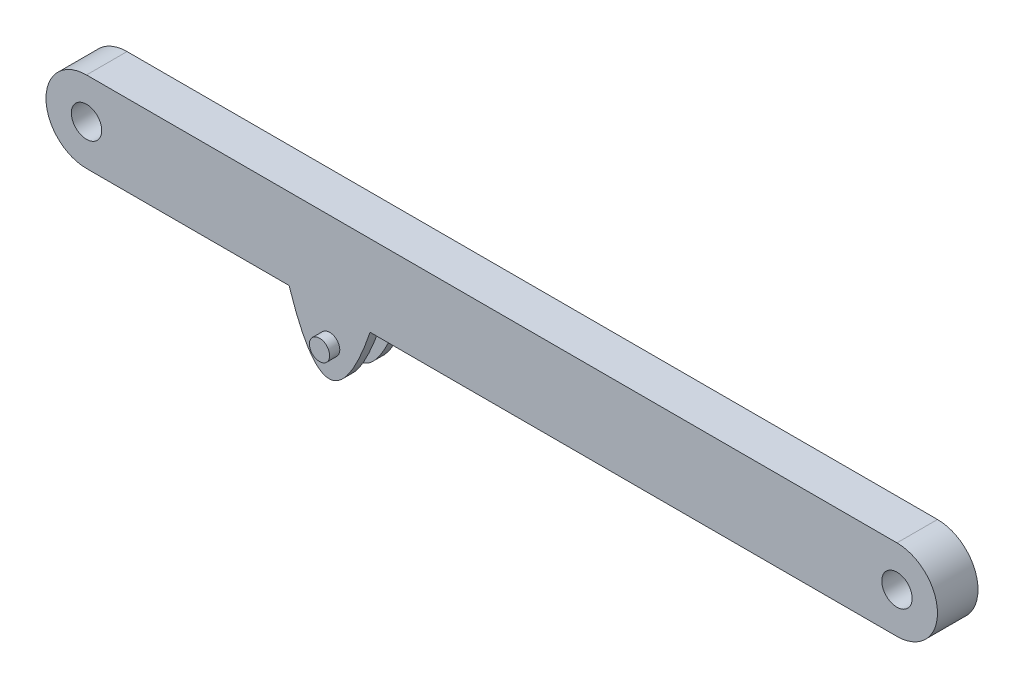
ISO-10303-21;
HEADER;
FILE_DESCRIPTION(('STEP AP214'),'2;1');
FILE_NAME('part.step','',(''),(''),'','','');
FILE_SCHEMA(('AUTOMOTIVE_DESIGN { 1 0 10303 214 1 1 1 1 }'));
ENDSEC;
DATA;
#1=APPLICATION_CONTEXT('core data for automotive mechanical design processes');
#2=APPLICATION_PROTOCOL_DEFINITION('international standard','automotive_design',2000,#1);
#3=PRODUCT_CONTEXT('',#1,'mechanical');
#4=PRODUCT('Part','Part','',(#3));
#5=PRODUCT_RELATED_PRODUCT_CATEGORY('part','',(#4));
#6=PRODUCT_DEFINITION_FORMATION('','',#4);
#7=PRODUCT_DEFINITION_CONTEXT('part definition',#1,'design');
#8=PRODUCT_DEFINITION('design','',#6,#7);
#9=PRODUCT_DEFINITION_SHAPE('','',#8);
#10=(LENGTH_UNIT() NAMED_UNIT(*) SI_UNIT(.MILLI.,.METRE.));
#11=(NAMED_UNIT(*) PLANE_ANGLE_UNIT() SI_UNIT($,.RADIAN.));
#12=(NAMED_UNIT(*) SI_UNIT($,.STERADIAN.) SOLID_ANGLE_UNIT());
#13=UNCERTAINTY_MEASURE_WITH_UNIT(LENGTH_MEASURE(1.E-05),#10,'distance_accuracy_value','');
#14=(GEOMETRIC_REPRESENTATION_CONTEXT(3) GLOBAL_UNCERTAINTY_ASSIGNED_CONTEXT((#13)) GLOBAL_UNIT_ASSIGNED_CONTEXT((#10,
#11,#12)) REPRESENTATION_CONTEXT('',''));
#15=CARTESIAN_POINT('',(0.,0.,0.));
#16=DIRECTION('',(0.,0.,1.));
#17=DIRECTION('',(1.,0.,0.));
#18=AXIS2_PLACEMENT_3D('',#15,#16,#17);
#19=CARTESIAN_POINT('',(-200.,0.,20.));
#20=DIRECTION('',(0.,0.,1.));
#21=DIRECTION('',(1.,0.,0.));
#22=AXIS2_PLACEMENT_3D('',#19,#20,#21);
#23=PLANE('',#22);
#24=CARTESIAN_POINT('',(-200.,0.,20.));
#25=DIRECTION('',(0.,0.,1.));
#26=DIRECTION('',(1.,0.,0.));
#27=AXIS2_PLACEMENT_3D('',#24,#25,#26);
#28=CIRCLE('',#27,20.);
#29=CARTESIAN_POINT('',(-200.,20.,20.));
#30=VERTEX_POINT('',#29);
#31=CARTESIAN_POINT('',(-200.,-20.,20.));
#32=VERTEX_POINT('',#31);
#33=EDGE_CURVE('E259',#30,#32,#28,.T.);
#34=ORIENTED_EDGE('',*,*,#33,.T.);
#35=DIRECTION('',(1.,0.,0.));
#36=VECTOR('',#35,1.);
#37=CARTESIAN_POINT('',(-200.,-20.,20.));
#38=LINE('',#37,#36);
#39=CARTESIAN_POINT('',(-100.037555,-20.,20.));
#40=VERTEX_POINT('',#39);
#41=EDGE_CURVE('E304',#32,#40,#38,.T.);
#42=ORIENTED_EDGE('',*,*,#41,.T.);
#43=CARTESIAN_POINT('',(-100.037555,-20.,20.));
#44=CARTESIAN_POINT('',(-80.4932082001175,-80.001537629147,20.));
#45=CARTESIAN_POINT('',(-60.037555,-20.,20.));
#46=B_SPLINE_CURVE_WITH_KNOTS('',2,(#43,#44,#45),.UNSPECIFIED.,.F.,.F.,(3,3),(0.,1.),.UNSPECIFIED.);
#47=CARTESIAN_POINT('',(-60.037555,-20.,20.));
#48=VERTEX_POINT('',#47);
#49=EDGE_CURVE('E55',#40,#48,#46,.T.);
#50=ORIENTED_EDGE('',*,*,#49,.T.);
#51=CARTESIAN_POINT('',(200.,-19.9999999999999,20.));
#52=VERTEX_POINT('',#51);
#53=EDGE_CURVE('E303',#48,#52,#38,.T.);
#54=ORIENTED_EDGE('',*,*,#53,.T.);
#55=CARTESIAN_POINT('',(200.,0.,20.));
#56=DIRECTION('',(0.,0.,1.));
#57=DIRECTION('',(1.,0.,0.));
#58=AXIS2_PLACEMENT_3D('',#55,#56,#57);
#59=CIRCLE('',#58,20.);
#60=CARTESIAN_POINT('',(200.,20.0000000000001,20.));
#61=VERTEX_POINT('',#60);
#62=EDGE_CURVE('E306',#52,#61,#59,.T.);
#63=ORIENTED_EDGE('',*,*,#62,.T.);
#64=DIRECTION('',(-1.,0.,0.));
#65=VECTOR('',#64,1.);
#66=CARTESIAN_POINT('',(-200.,20.,20.));
#67=LINE('',#66,#65);
#68=EDGE_CURVE('E250',#61,#30,#67,.T.);
#69=ORIENTED_EDGE('',*,*,#68,.T.);
#70=EDGE_LOOP('',(#34,#42,#50,#54,#63,#69));
#71=FACE_BOUND('',#70,.T.);
#72=CARTESIAN_POINT('',(200.,0.,20.));
#73=DIRECTION('',(0.,0.,1.));
#74=DIRECTION('',(1.,0.,0.));
#75=AXIS2_PLACEMENT_3D('',#72,#73,#74);
#76=CIRCLE('',#75,7.50000000000001);
#77=CARTESIAN_POINT('',(207.5,0.,20.));
#78=VERTEX_POINT('',#77);
#79=EDGE_CURVE('E247',#78,#78,#76,.T.);
#80=ORIENTED_EDGE('',*,*,#79,.F.);
#81=EDGE_LOOP('',(#80));
#82=FACE_BOUND('',#81,.T.);
#83=CARTESIAN_POINT('',(-200.,0.,20.));
#84=DIRECTION('',(0.,0.,1.));
#85=DIRECTION('',(1.,0.,0.));
#86=AXIS2_PLACEMENT_3D('',#83,#84,#85);
#87=CIRCLE('',#86,7.50000000000001);
#88=CARTESIAN_POINT('',(-192.5,0.,20.));
#89=VERTEX_POINT('',#88);
#90=EDGE_CURVE('E289',#89,#89,#87,.T.);
#91=ORIENTED_EDGE('',*,*,#90,.F.);
#92=EDGE_LOOP('',(#91));
#93=FACE_BOUND('',#92,.T.);
#94=CARTESIAN_POINT('',(-80.,-35.,20.));
#95=DIRECTION('',(0.,0.,1.));
#96=DIRECTION('',(1.,0.,0.));
#97=AXIS2_PLACEMENT_3D('',#94,#95,#96);
#98=CIRCLE('',#97,4.99999999999999);
#99=CARTESIAN_POINT('',(-75.,-35.,20.));
#100=VERTEX_POINT('',#99);
#101=EDGE_CURVE('E137',#100,#100,#98,.F.);
#102=ORIENTED_EDGE('',*,*,#101,.T.);
#103=EDGE_LOOP('',(#102));
#104=FACE_BOUND('',#103,.T.);
#105=ADVANCED_FACE('F39',(#71,#82,#93,#104),#23,.T.);
#106=CARTESIAN_POINT('',(-80.2653816000587,-50.0007688145735,15.));
#107=DIRECTION('',(0.,0.,1.));
#108=DIRECTION('',(-1.,0.,0.));
#109=AXIS2_PLACEMENT_3D('',#106,#107,#108);
#110=PLANE('',#109);
#111=CARTESIAN_POINT('',(-100.037555,-20.,15.));
#112=CARTESIAN_POINT('',(-80.4932082001175,-80.001537629147,15.));
#113=CARTESIAN_POINT('',(-60.037555,-20.,15.));
#114=B_SPLINE_CURVE_WITH_KNOTS('',2,(#111,#112,#113),.UNSPECIFIED.,.F.,.F.,(3,3),(0.,1.),.UNSPECIFIED.);
#115=CARTESIAN_POINT('',(-100.037555,-20.,15.));
#116=VERTEX_POINT('',#115);
#117=CARTESIAN_POINT('',(-60.037555,-20.,15.));
#118=VERTEX_POINT('',#117);
#119=EDGE_CURVE('E107',#116,#118,#114,.T.);
#120=ORIENTED_EDGE('',*,*,#119,.F.);
#121=DIRECTION('',(-1.,0.,0.));
#122=VECTOR('',#121,1.);
#123=CARTESIAN_POINT('',(-100.037555,-20.,15.));
#124=LINE('',#123,#122);
#125=EDGE_CURVE('E117',#118,#116,#124,.T.);
#126=ORIENTED_EDGE('',*,*,#125,.F.);
#127=EDGE_LOOP('',(#120,#126));
#128=FACE_BOUND('',#127,.T.);
#129=CARTESIAN_POINT('',(-80.,-35.,15.));
#130=DIRECTION('',(0.,0.,1.));
#131=DIRECTION('',(1.,0.,0.));
#132=AXIS2_PLACEMENT_3D('',#129,#130,#131);
#133=CIRCLE('',#132,4.99999999999999);
#134=CARTESIAN_POINT('',(-75.,-35.,15.));
#135=VERTEX_POINT('',#134);
#136=EDGE_CURVE('E11',#135,#135,#133,.F.);
#137=ORIENTED_EDGE('',*,*,#136,.F.);
#138=EDGE_LOOP('',(#137));
#139=FACE_BOUND('',#138,.T.);
#140=ADVANCED_FACE('F115',(#128,#139),#110,.F.);
#141=CARTESIAN_POINT('',(-200.,-20.,20.));
#142=DIRECTION('',(0.,1.,0.));
#143=DIRECTION('',(-1.,0.,0.));
#144=AXIS2_PLACEMENT_3D('',#141,#142,#143);
#145=PLANE('',#144);
#146=ORIENTED_EDGE('',*,*,#125,.T.);
#147=DIRECTION('',(0.,0.,1.));
#148=VECTOR('',#147,1.);
#149=CARTESIAN_POINT('',(-100.037555,-20.,15.));
#150=LINE('',#149,#148);
#151=EDGE_CURVE('E104',#116,#40,#150,.T.);
#152=ORIENTED_EDGE('',*,*,#151,.T.);
#153=ORIENTED_EDGE('',*,*,#41,.F.);
#154=DIRECTION('',(0.,0.,-1.));
#155=VECTOR('',#154,1.);
#156=CARTESIAN_POINT('',(-200.,-20.,20.));
#157=LINE('',#156,#155);
#158=CARTESIAN_POINT('',(-200.,-20.,0.));
#159=VERTEX_POINT('',#158);
#160=EDGE_CURVE('E48',#32,#159,#157,.T.);
#161=ORIENTED_EDGE('',*,*,#160,.T.);
#162=DIRECTION('',(1.,0.,0.));
#163=VECTOR('',#162,1.);
#164=CARTESIAN_POINT('',(-200.,-20.,0.));
#165=LINE('',#164,#163);
#166=CARTESIAN_POINT('',(-100.037555,-20.,0.));
#167=VERTEX_POINT('',#166);
#168=EDGE_CURVE('E237',#159,#167,#165,.T.);
#169=ORIENTED_EDGE('',*,*,#168,.T.);
#170=DIRECTION('',(0.,0.,-1.));
#171=VECTOR('',#170,1.);
#172=CARTESIAN_POINT('',(-100.037555,-20.,5.));
#173=LINE('',#172,#171);
#174=CARTESIAN_POINT('',(-100.037555,-20.,5.));
#175=VERTEX_POINT('',#174);
#176=EDGE_CURVE('E63',#175,#167,#173,.T.);
#177=ORIENTED_EDGE('',*,*,#176,.F.);
#178=DIRECTION('',(-1.,0.,0.));
#179=VECTOR('',#178,1.);
#180=CARTESIAN_POINT('',(-100.037555,-20.,5.));
#181=LINE('',#180,#179);
#182=CARTESIAN_POINT('',(-60.037555,-20.,5.));
#183=VERTEX_POINT('',#182);
#184=EDGE_CURVE('E158',#183,#175,#181,.T.);
#185=ORIENTED_EDGE('',*,*,#184,.F.);
#186=DIRECTION('',(0.,0.,-1.));
#187=VECTOR('',#186,1.);
#188=CARTESIAN_POINT('',(-60.037555,-20.,5.));
#189=LINE('',#188,#187);
#190=CARTESIAN_POINT('',(-60.037555,-20.,0.));
#191=VERTEX_POINT('',#190);
#192=EDGE_CURVE('E285',#183,#191,#189,.T.);
#193=ORIENTED_EDGE('',*,*,#192,.T.);
#194=CARTESIAN_POINT('',(200.,-19.9999999999999,0.));
#195=VERTEX_POINT('',#194);
#196=EDGE_CURVE('E242',#191,#195,#165,.T.);
#197=ORIENTED_EDGE('',*,*,#196,.T.);
#198=DIRECTION('',(0.,0.,-1.));
#199=VECTOR('',#198,1.);
#200=CARTESIAN_POINT('',(200.,-19.9999999999999,20.));
#201=LINE('',#200,#199);
#202=EDGE_CURVE('E267',#52,#195,#201,.T.);
#203=ORIENTED_EDGE('',*,*,#202,.F.);
#204=ORIENTED_EDGE('',*,*,#53,.F.);
#205=DIRECTION('',(0.,0.,1.));
#206=VECTOR('',#205,1.);
#207=CARTESIAN_POINT('',(-60.037555,-20.,15.));
#208=LINE('',#207,#206);
#209=EDGE_CURVE('E112',#118,#48,#208,.T.);
#210=ORIENTED_EDGE('',*,*,#209,.F.);
#211=EDGE_LOOP('',(#146,#152,#153,#161,#169,#177,#185,#193,#197,#203,#204,#210));
#212=FACE_BOUND('',#211,.T.);
#213=ADVANCED_FACE('F121',(#212),#145,.F.);
#214=CARTESIAN_POINT('',(-200.,0.,20.));
#215=DIRECTION('',(0.,0.,-1.));
#216=DIRECTION('',(-1.,0.,0.));
#217=AXIS2_PLACEMENT_3D('',#214,#215,#216);
#218=CYLINDRICAL_SURFACE('',#217,20.);
#219=CARTESIAN_POINT('',(-200.,0.,0.));
#220=DIRECTION('',(0.,0.,1.));
#221=DIRECTION('',(1.,0.,0.));
#222=AXIS2_PLACEMENT_3D('',#219,#220,#221);
#223=CIRCLE('',#222,20.);
#224=CARTESIAN_POINT('',(-200.,20.,0.));
#225=VERTEX_POINT('',#224);
#226=EDGE_CURVE('E233',#225,#159,#223,.T.);
#227=ORIENTED_EDGE('',*,*,#226,.T.);
#228=ORIENTED_EDGE('',*,*,#160,.F.);
#229=ORIENTED_EDGE('',*,*,#33,.F.);
#230=DIRECTION('',(0.,0.,-1.));
#231=VECTOR('',#230,1.);
#232=CARTESIAN_POINT('',(-200.,20.,20.));
#233=LINE('',#232,#231);
#234=EDGE_CURVE('E260',#30,#225,#233,.T.);
#235=ORIENTED_EDGE('',*,*,#234,.T.);
#236=EDGE_LOOP('',(#227,#228,#229,#235));
#237=FACE_BOUND('',#236,.T.);
#238=ADVANCED_FACE('F41',(#237),#218,.T.);
#239=CARTESIAN_POINT('',(200.,0.,20.));
#240=DIRECTION('',(0.,0.,-1.));
#241=DIRECTION('',(-1.,0.,0.));
#242=AXIS2_PLACEMENT_3D('',#239,#240,#241);
#243=CYLINDRICAL_SURFACE('',#242,20.);
#244=CARTESIAN_POINT('',(200.,0.,0.));
#245=DIRECTION('',(0.,0.,1.));
#246=DIRECTION('',(1.,0.,0.));
#247=AXIS2_PLACEMENT_3D('',#244,#245,#246);
#248=CIRCLE('',#247,20.);
#249=CARTESIAN_POINT('',(200.,20.0000000000001,0.));
#250=VERTEX_POINT('',#249);
#251=EDGE_CURVE('E254',#195,#250,#248,.T.);
#252=ORIENTED_EDGE('',*,*,#251,.T.);
#253=DIRECTION('',(0.,0.,-1.));
#254=VECTOR('',#253,1.);
#255=CARTESIAN_POINT('',(200.,20.0000000000001,20.));
#256=LINE('',#255,#254);
#257=EDGE_CURVE('E263',#61,#250,#256,.T.);
#258=ORIENTED_EDGE('',*,*,#257,.F.);
#259=ORIENTED_EDGE('',*,*,#62,.F.);
#260=ORIENTED_EDGE('',*,*,#202,.T.);
#261=EDGE_LOOP('',(#252,#258,#259,#260));
#262=FACE_BOUND('',#261,.T.);
#263=ADVANCED_FACE('F188',(#262),#243,.T.);
#264=CARTESIAN_POINT('',(-200.,20.,20.));
#265=DIRECTION('',(0.,-1.,0.));
#266=DIRECTION('',(1.,0.,0.));
#267=AXIS2_PLACEMENT_3D('',#264,#265,#266);
#268=PLANE('',#267);
#269=DIRECTION('',(-1.,0.,0.));
#270=VECTOR('',#269,1.);
#271=CARTESIAN_POINT('',(-200.,20.,0.));
#272=LINE('',#271,#270);
#273=EDGE_CURVE('E235',#250,#225,#272,.T.);
#274=ORIENTED_EDGE('',*,*,#273,.T.);
#275=ORIENTED_EDGE('',*,*,#234,.F.);
#276=ORIENTED_EDGE('',*,*,#68,.F.);
#277=ORIENTED_EDGE('',*,*,#257,.T.);
#278=EDGE_LOOP('',(#274,#275,#276,#277));
#279=FACE_BOUND('',#278,.T.);
#280=ADVANCED_FACE('F184',(#279),#268,.F.);
#281=CARTESIAN_POINT('',(-200.,0.,0.));
#282=DIRECTION('',(0.,0.,1.));
#283=DIRECTION('',(1.,0.,0.));
#284=AXIS2_PLACEMENT_3D('',#281,#282,#283);
#285=PLANE('',#284);
#286=CARTESIAN_POINT('',(-80.,-35.,0.));
#287=DIRECTION('',(0.,0.,1.));
#288=DIRECTION('',(1.,0.,0.));
#289=AXIS2_PLACEMENT_3D('',#286,#287,#288);
#290=CIRCLE('',#289,4.99999999999999);
#291=CARTESIAN_POINT('',(-75.,-35.,0.));
#292=VERTEX_POINT('',#291);
#293=EDGE_CURVE('E146',#292,#292,#290,.T.);
#294=ORIENTED_EDGE('',*,*,#293,.T.);
#295=EDGE_LOOP('',(#294));
#296=FACE_BOUND('',#295,.T.);
#297=CARTESIAN_POINT('',(-200.,0.,0.));
#298=DIRECTION('',(0.,0.,1.));
#299=DIRECTION('',(1.,0.,0.));
#300=AXIS2_PLACEMENT_3D('',#297,#298,#299);
#301=CIRCLE('',#300,7.50000000000001);
#302=CARTESIAN_POINT('',(-192.5,0.,0.));
#303=VERTEX_POINT('',#302);
#304=EDGE_CURVE('E225',#303,#303,#301,.T.);
#305=ORIENTED_EDGE('',*,*,#304,.T.);
#306=EDGE_LOOP('',(#305));
#307=FACE_BOUND('',#306,.T.);
#308=CARTESIAN_POINT('',(200.,0.,0.));
#309=DIRECTION('',(0.,0.,1.));
#310=DIRECTION('',(1.,0.,0.));
#311=AXIS2_PLACEMENT_3D('',#308,#309,#310);
#312=CIRCLE('',#311,7.50000000000001);
#313=CARTESIAN_POINT('',(207.5,0.,0.));
#314=VERTEX_POINT('',#313);
#315=EDGE_CURVE('E229',#314,#314,#312,.T.);
#316=ORIENTED_EDGE('',*,*,#315,.T.);
#317=EDGE_LOOP('',(#316));
#318=FACE_BOUND('',#317,.T.);
#319=ORIENTED_EDGE('',*,*,#226,.F.);
#320=ORIENTED_EDGE('',*,*,#273,.F.);
#321=ORIENTED_EDGE('',*,*,#251,.F.);
#322=ORIENTED_EDGE('',*,*,#196,.F.);
#323=CARTESIAN_POINT('',(-100.037555,-20.,0.));
#324=CARTESIAN_POINT('',(-80.4932082001175,-80.001537629147,0.));
#325=CARTESIAN_POINT('',(-60.037555,-20.,0.));
#326=B_SPLINE_CURVE_WITH_KNOTS('',2,(#323,#324,#325),.UNSPECIFIED.,.F.,.F.,(3,3),(0.,1.),.UNSPECIFIED.);
#327=EDGE_CURVE('E150',#167,#191,#326,.T.);
#328=ORIENTED_EDGE('',*,*,#327,.F.);
#329=ORIENTED_EDGE('',*,*,#168,.F.);
#330=EDGE_LOOP('',(#319,#320,#321,#322,#328,#329));
#331=FACE_BOUND('',#330,.T.);
#332=ADVANCED_FACE('F178',(#296,#307,#318,#331),#285,.F.);
#333=CARTESIAN_POINT('',(200.,0.,0.));
#334=DIRECTION('',(0.,0.,1.));
#335=DIRECTION('',(1.,0.,0.));
#336=AXIS2_PLACEMENT_3D('',#333,#334,#335);
#337=CYLINDRICAL_SURFACE('',#336,7.50000000000001);
#338=ORIENTED_EDGE('',*,*,#315,.F.);
#339=EDGE_LOOP('',(#338));
#340=FACE_BOUND('',#339,.T.);
#341=ORIENTED_EDGE('',*,*,#79,.T.);
#342=EDGE_LOOP('',(#341));
#343=FACE_BOUND('',#342,.T.);
#344=ADVANCED_FACE('F174',(#340,#343),#337,.F.);
#345=CARTESIAN_POINT('',(-200.,0.,0.));
#346=DIRECTION('',(0.,0.,1.));
#347=DIRECTION('',(1.,0.,0.));
#348=AXIS2_PLACEMENT_3D('',#345,#346,#347);
#349=CYLINDRICAL_SURFACE('',#348,7.50000000000001);
#350=ORIENTED_EDGE('',*,*,#304,.F.);
#351=EDGE_LOOP('',(#350));
#352=FACE_BOUND('',#351,.T.);
#353=ORIENTED_EDGE('',*,*,#90,.T.);
#354=EDGE_LOOP('',(#353));
#355=FACE_BOUND('',#354,.T.);
#356=ADVANCED_FACE('F169',(#352,#355),#349,.F.);
#357=CARTESIAN_POINT('',(-100.037555,-20.,5.));
#358=CARTESIAN_POINT('',(-80.4932082001175,-80.001537629147,5.));
#359=CARTESIAN_POINT('',(-60.037555,-20.,5.));
#360=B_SPLINE_CURVE_WITH_KNOTS('',2,(#357,#358,#359),.UNSPECIFIED.,.F.,.F.,(3,3),(0.,1.),.UNSPECIFIED.);
#361=DIRECTION('',(0.,0.,-1.));
#362=VECTOR('',#361,1.);
#363=SURFACE_OF_LINEAR_EXTRUSION('',#360,#362);
#364=ORIENTED_EDGE('',*,*,#327,.T.);
#365=ORIENTED_EDGE('',*,*,#192,.F.);
#366=EDGE_CURVE('E151',#175,#183,#360,.T.);
#367=ORIENTED_EDGE('',*,*,#366,.F.);
#368=ORIENTED_EDGE('',*,*,#176,.T.);
#369=EDGE_LOOP('',(#364,#365,#367,#368));
#370=FACE_BOUND('',#369,.T.);
#371=ADVANCED_FACE('F164',(#370),#363,.F.);
#372=CARTESIAN_POINT('',(-80.2653816000587,-50.0007688145735,5.));
#373=DIRECTION('',(0.,0.,-1.));
#374=DIRECTION('',(-1.,0.,0.));
#375=AXIS2_PLACEMENT_3D('',#372,#373,#374);
#376=PLANE('',#375);
#377=CARTESIAN_POINT('',(-80.,-35.,5.));
#378=DIRECTION('',(0.,0.,-1.));
#379=DIRECTION('',(-1.,0.,0.));
#380=AXIS2_PLACEMENT_3D('',#377,#378,#379);
#381=CIRCLE('',#380,4.99999999999999);
#382=CARTESIAN_POINT('',(-85.,-35.,5.));
#383=VERTEX_POINT('',#382);
#384=EDGE_CURVE('E145',#383,#383,#381,.T.);
#385=ORIENTED_EDGE('',*,*,#384,.T.);
#386=EDGE_LOOP('',(#385));
#387=FACE_BOUND('',#386,.T.);
#388=ORIENTED_EDGE('',*,*,#366,.T.);
#389=ORIENTED_EDGE('',*,*,#184,.T.);
#390=EDGE_LOOP('',(#388,#389));
#391=FACE_BOUND('',#390,.T.);
#392=ADVANCED_FACE('F168',(#387,#391),#376,.F.);
#393=CARTESIAN_POINT('',(-80.,-35.,-5.));
#394=DIRECTION('',(0.,0.,1.));
#395=DIRECTION('',(1.,0.,0.));
#396=AXIS2_PLACEMENT_3D('',#393,#394,#395);
#397=CYLINDRICAL_SURFACE('',#396,4.99999999999999);
#398=ORIENTED_EDGE('',*,*,#384,.F.);
#399=EDGE_LOOP('',(#398));
#400=FACE_BOUND('',#399,.T.);
#401=ORIENTED_EDGE('',*,*,#136,.T.);
#402=EDGE_LOOP('',(#401));
#403=FACE_BOUND('',#402,.T.);
#404=ADVANCED_FACE('F212',(#400,#403),#397,.T.);
#405=CARTESIAN_POINT('',(-80.,-35.,-5.));
#406=DIRECTION('',(0.,0.,1.));
#407=DIRECTION('',(1.,0.,0.));
#408=AXIS2_PLACEMENT_3D('',#405,#406,#407);
#409=CIRCLE('',#408,4.99999999999999);
#410=CARTESIAN_POINT('',(-75.,-35.,-5.));
#411=VERTEX_POINT('',#410);
#412=EDGE_CURVE('E111',#411,#411,#409,.T.);
#413=ORIENTED_EDGE('',*,*,#412,.T.);
#414=EDGE_LOOP('',(#413));
#415=FACE_BOUND('',#414,.T.);
#416=ORIENTED_EDGE('',*,*,#293,.F.);
#417=EDGE_LOOP('',(#416));
#418=FACE_BOUND('',#417,.T.);
#419=ADVANCED_FACE('F209',(#415,#418),#397,.T.);
#420=CARTESIAN_POINT('',(-80.,-35.,-5.));
#421=DIRECTION('',(0.,0.,1.));
#422=DIRECTION('',(1.,0.,0.));
#423=AXIS2_PLACEMENT_3D('',#420,#421,#422);
#424=PLANE('',#423);
#425=ORIENTED_EDGE('',*,*,#412,.F.);
#426=EDGE_LOOP('',(#425));
#427=FACE_BOUND('',#426,.T.);
#428=ADVANCED_FACE('F207',(#427),#424,.F.);
#429=DIRECTION('',(0.,0.,1.));
#430=VECTOR('',#429,1.);
#431=SURFACE_OF_LINEAR_EXTRUSION('',#114,#430);
#432=ORIENTED_EDGE('',*,*,#49,.F.);
#433=ORIENTED_EDGE('',*,*,#151,.F.);
#434=ORIENTED_EDGE('',*,*,#119,.T.);
#435=ORIENTED_EDGE('',*,*,#209,.T.);
#436=EDGE_LOOP('',(#432,#433,#434,#435));
#437=FACE_BOUND('',#436,.T.);
#438=ADVANCED_FACE('F106',(#437),#431,.T.);
#439=CARTESIAN_POINT('',(-80.,-35.,25.));
#440=DIRECTION('',(0.,0.,-1.));
#441=DIRECTION('',(-1.,0.,0.));
#442=AXIS2_PLACEMENT_3D('',#439,#440,#441);
#443=CYLINDRICAL_SURFACE('',#442,4.99999999999999);
#444=ORIENTED_EDGE('',*,*,#101,.F.);
#445=EDGE_LOOP('',(#444));
#446=FACE_BOUND('',#445,.T.);
#447=CARTESIAN_POINT('',(-80.,-35.,25.));
#448=DIRECTION('',(0.,0.,1.));
#449=DIRECTION('',(1.,0.,0.));
#450=AXIS2_PLACEMENT_3D('',#447,#448,#449);
#451=CIRCLE('',#450,4.99999999999999);
#452=CARTESIAN_POINT('',(-75.,-35.,25.));
#453=VERTEX_POINT('',#452);
#454=EDGE_CURVE('E329',#453,#453,#451,.T.);
#455=ORIENTED_EDGE('',*,*,#454,.F.);
#456=EDGE_LOOP('',(#455));
#457=FACE_BOUND('',#456,.T.);
#458=ADVANCED_FACE('F203',(#446,#457),#443,.T.);
#459=CARTESIAN_POINT('',(-80.,-35.,25.));
#460=DIRECTION('',(0.,0.,-1.));
#461=DIRECTION('',(1.,0.,0.));
#462=AXIS2_PLACEMENT_3D('',#459,#460,#461);
#463=PLANE('',#462);
#464=ORIENTED_EDGE('',*,*,#454,.T.);
#465=EDGE_LOOP('',(#464));
#466=FACE_BOUND('',#465,.T.);
#467=ADVANCED_FACE('F335',(#466),#463,.F.);
#468=CLOSED_SHELL('',(#105,#140,#213,#238,#263,#280,#332,#344,#356,#371,#392,#404,#419,#428,
#438,#458,#467));
#469=MANIFOLD_SOLID_BREP('B2',#468);
#470=ADVANCED_BREP_SHAPE_REPRESENTATION('',(#18,#469),#14);
#471=SHAPE_DEFINITION_REPRESENTATION(#9,#470);
ENDSEC;
END-ISO-10303-21;
